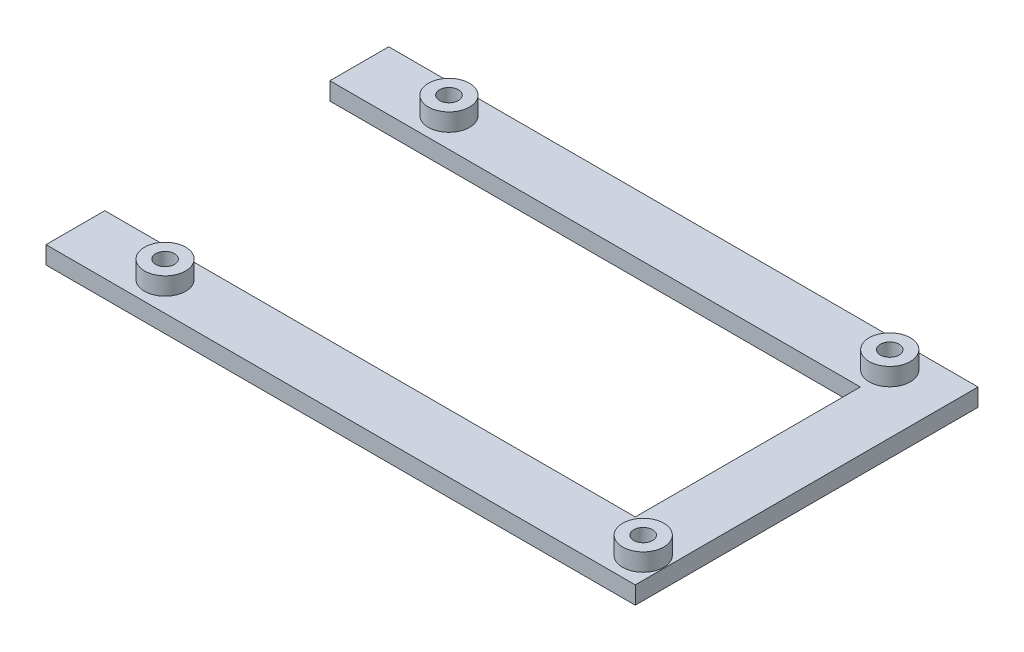
ISO-10303-21;
HEADER;
FILE_DESCRIPTION(('STEP AP214'),'2;1');
FILE_NAME('part.step','',(''),(''),'','','');
FILE_SCHEMA(('AUTOMOTIVE_DESIGN { 1 0 10303 214 1 1 1 1 }'));
ENDSEC;
DATA;
#1=APPLICATION_CONTEXT('core data for automotive mechanical design processes');
#2=APPLICATION_PROTOCOL_DEFINITION('international standard','automotive_design',2000,#1);
#3=PRODUCT_CONTEXT('',#1,'mechanical');
#4=PRODUCT('Part','Part','',(#3));
#5=PRODUCT_RELATED_PRODUCT_CATEGORY('part','',(#4));
#6=PRODUCT_DEFINITION_FORMATION('','',#4);
#7=PRODUCT_DEFINITION_CONTEXT('part definition',#1,'design');
#8=PRODUCT_DEFINITION('design','',#6,#7);
#9=PRODUCT_DEFINITION_SHAPE('','',#8);
#10=(LENGTH_UNIT() NAMED_UNIT(*) SI_UNIT(.MILLI.,.METRE.));
#11=(NAMED_UNIT(*) PLANE_ANGLE_UNIT() SI_UNIT($,.RADIAN.));
#12=(NAMED_UNIT(*) SI_UNIT($,.STERADIAN.) SOLID_ANGLE_UNIT());
#13=UNCERTAINTY_MEASURE_WITH_UNIT(LENGTH_MEASURE(1.E-05),#10,'distance_accuracy_value','');
#14=(GEOMETRIC_REPRESENTATION_CONTEXT(3) GLOBAL_UNCERTAINTY_ASSIGNED_CONTEXT((#13)) GLOBAL_UNIT_ASSIGNED_CONTEXT((#10,
#11,#12)) REPRESENTATION_CONTEXT('',''));
#15=CARTESIAN_POINT('',(0.,0.,0.));
#16=DIRECTION('',(0.,0.,1.));
#17=DIRECTION('',(1.,0.,0.));
#18=AXIS2_PLACEMENT_3D('',#15,#16,#17);
#19=CARTESIAN_POINT('',(0.,3.,0.));
#20=DIRECTION('',(0.,-1.,0.));
#21=DIRECTION('',(0.,0.,-1.));
#22=AXIS2_PLACEMENT_3D('',#19,#20,#21);
#23=PLANE('',#22);
#24=CARTESIAN_POINT('',(96.52,3.,-2.54));
#25=DIRECTION('',(0.,-1.,0.));
#26=DIRECTION('',(0.,0.,-1.));
#27=AXIS2_PLACEMENT_3D('',#24,#25,#26);
#28=CIRCLE('',#27,3.50000000000001);
#29=CARTESIAN_POINT('',(96.52,3.,-6.04000000000001));
#30=VERTEX_POINT('',#29);
#31=EDGE_CURVE('E150',#30,#30,#28,.F.);
#32=ORIENTED_EDGE('',*,*,#31,.F.);
#33=EDGE_LOOP('',(#32));
#34=FACE_BOUND('',#33,.T.);
#35=CARTESIAN_POINT('',(15.24,3.,-50.8));
#36=DIRECTION('',(0.,-1.,0.));
#37=DIRECTION('',(0.,0.,-1.));
#38=AXIS2_PLACEMENT_3D('',#35,#36,#37);
#39=CIRCLE('',#38,3.5);
#40=CARTESIAN_POINT('',(15.24,3.,-54.3));
#41=VERTEX_POINT('',#40);
#42=EDGE_CURVE('E262',#41,#41,#39,.F.);
#43=ORIENTED_EDGE('',*,*,#42,.F.);
#44=EDGE_LOOP('',(#43));
#45=FACE_BOUND('',#44,.T.);
#46=DIRECTION('',(0.,0.,-1.));
#47=VECTOR('',#46,1.);
#48=CARTESIAN_POINT('',(0.,3.,-45.8));
#49=LINE('',#48,#47);
#50=CARTESIAN_POINT('',(0.,3.,-45.8));
#51=VERTEX_POINT('',#50);
#52=CARTESIAN_POINT('',(0.,3.,-55.8));
#53=VERTEX_POINT('',#52);
#54=EDGE_CURVE('E260',#51,#53,#49,.T.);
#55=ORIENTED_EDGE('',*,*,#54,.F.);
#56=DIRECTION('',(1.,0.,0.));
#57=VECTOR('',#56,1.);
#58=CARTESIAN_POINT('',(0.,3.,-45.8));
#59=LINE('',#58,#57);
#60=CARTESIAN_POINT('',(90.17,3.,-45.8));
#61=VERTEX_POINT('',#60);
#62=EDGE_CURVE('E230',#51,#61,#59,.T.);
#63=ORIENTED_EDGE('',*,*,#62,.T.);
#64=DIRECTION('',(0.,0.,-1.));
#65=VECTOR('',#64,1.);
#66=CARTESIAN_POINT('',(90.17,3.,-7.54));
#67=LINE('',#66,#65);
#68=CARTESIAN_POINT('',(90.17,3.,-7.54));
#69=VERTEX_POINT('',#68);
#70=EDGE_CURVE('E216',#69,#61,#67,.T.);
#71=ORIENTED_EDGE('',*,*,#70,.F.);
#72=DIRECTION('',(1.,0.,0.));
#73=VECTOR('',#72,1.);
#74=CARTESIAN_POINT('',(0.,3.,-7.54));
#75=LINE('',#74,#73);
#76=CARTESIAN_POINT('',(0.,3.,-7.54));
#77=VERTEX_POINT('',#76);
#78=EDGE_CURVE('E229',#77,#69,#75,.T.);
#79=ORIENTED_EDGE('',*,*,#78,.F.);
#80=DIRECTION('',(0.,0.,1.));
#81=VECTOR('',#80,1.);
#82=CARTESIAN_POINT('',(0.,3.,-7.54));
#83=LINE('',#82,#81);
#84=CARTESIAN_POINT('',(0.,3.,2.46));
#85=VERTEX_POINT('',#84);
#86=EDGE_CURVE('E234',#77,#85,#83,.T.);
#87=ORIENTED_EDGE('',*,*,#86,.T.);
#88=DIRECTION('',(1.,0.,0.));
#89=VECTOR('',#88,1.);
#90=CARTESIAN_POINT('',(0.,3.,2.46));
#91=LINE('',#90,#89);
#92=CARTESIAN_POINT('',(100.17,3.,2.46));
#93=VERTEX_POINT('',#92);
#94=EDGE_CURVE('E236',#85,#93,#91,.T.);
#95=ORIENTED_EDGE('',*,*,#94,.T.);
#96=DIRECTION('',(0.,0.,-1.));
#97=VECTOR('',#96,1.);
#98=CARTESIAN_POINT('',(100.17,3.,2.46));
#99=LINE('',#98,#97);
#100=CARTESIAN_POINT('',(100.17,3.,-55.8));
#101=VERTEX_POINT('',#100);
#102=EDGE_CURVE('E355',#93,#101,#99,.T.);
#103=ORIENTED_EDGE('',*,*,#102,.T.);
#104=DIRECTION('',(1.,0.,0.));
#105=VECTOR('',#104,1.);
#106=CARTESIAN_POINT('',(0.,3.,-55.8));
#107=LINE('',#106,#105);
#108=EDGE_CURVE('E353',#53,#101,#107,.T.);
#109=ORIENTED_EDGE('',*,*,#108,.F.);
#110=EDGE_LOOP('',(#55,#63,#71,#79,#87,#95,#103,#109));
#111=FACE_BOUND('',#110,.T.);
#112=CARTESIAN_POINT('',(90.17,3.,-50.8));
#113=DIRECTION('',(0.,-1.,0.));
#114=DIRECTION('',(0.,0.,-1.));
#115=AXIS2_PLACEMENT_3D('',#112,#113,#114);
#116=CIRCLE('',#115,3.50000000000001);
#117=CARTESIAN_POINT('',(90.17,3.,-54.3));
#118=VERTEX_POINT('',#117);
#119=EDGE_CURVE('E276',#118,#118,#116,.F.);
#120=ORIENTED_EDGE('',*,*,#119,.F.);
#121=EDGE_LOOP('',(#120));
#122=FACE_BOUND('',#121,.T.);
#123=CARTESIAN_POINT('',(15.24,3.,-2.54));
#124=DIRECTION('',(0.,-1.,0.));
#125=DIRECTION('',(0.,0.,-1.));
#126=AXIS2_PLACEMENT_3D('',#123,#124,#125);
#127=CIRCLE('',#126,3.5);
#128=CARTESIAN_POINT('',(15.24,3.,-6.04));
#129=VERTEX_POINT('',#128);
#130=EDGE_CURVE('E12',#129,#129,#127,.F.);
#131=ORIENTED_EDGE('',*,*,#130,.F.);
#132=EDGE_LOOP('',(#131));
#133=FACE_BOUND('',#132,.T.);
#134=ADVANCED_FACE('F141',(#34,#45,#111,#122,#133),#23,.F.);
#135=CARTESIAN_POINT('',(0.,0.,0.));
#136=DIRECTION('',(0.,-1.,0.));
#137=DIRECTION('',(0.,0.,-1.));
#138=AXIS2_PLACEMENT_3D('',#135,#136,#137);
#139=PLANE('',#138);
#140=CARTESIAN_POINT('',(96.52,0.,-2.54));
#141=DIRECTION('',(0.,1.,0.));
#142=DIRECTION('',(0.,0.,1.));
#143=AXIS2_PLACEMENT_3D('',#140,#141,#142);
#144=CIRCLE('',#143,1.60000000000001);
#145=CARTESIAN_POINT('',(96.52,0.,-0.939999999999995));
#146=VERTEX_POINT('',#145);
#147=EDGE_CURVE('E370',#146,#146,#144,.T.);
#148=ORIENTED_EDGE('',*,*,#147,.T.);
#149=EDGE_LOOP('',(#148));
#150=FACE_BOUND('',#149,.T.);
#151=CARTESIAN_POINT('',(15.24,0.,-2.54));
#152=DIRECTION('',(0.,1.,0.));
#153=DIRECTION('',(0.,0.,1.));
#154=AXIS2_PLACEMENT_3D('',#151,#152,#153);
#155=CIRCLE('',#154,1.6);
#156=CARTESIAN_POINT('',(15.24,0.,-0.94));
#157=VERTEX_POINT('',#156);
#158=EDGE_CURVE('E245',#157,#157,#155,.T.);
#159=ORIENTED_EDGE('',*,*,#158,.T.);
#160=EDGE_LOOP('',(#159));
#161=FACE_BOUND('',#160,.T.);
#162=DIRECTION('',(0.,0.,-1.));
#163=VECTOR('',#162,1.);
#164=CARTESIAN_POINT('',(0.,0.,-45.8));
#165=LINE('',#164,#163);
#166=CARTESIAN_POINT('',(0.,0.,-45.8));
#167=VERTEX_POINT('',#166);
#168=CARTESIAN_POINT('',(0.,0.,-55.8));
#169=VERTEX_POINT('',#168);
#170=EDGE_CURVE('E241',#167,#169,#165,.T.);
#171=ORIENTED_EDGE('',*,*,#170,.T.);
#172=DIRECTION('',(1.,0.,0.));
#173=VECTOR('',#172,1.);
#174=CARTESIAN_POINT('',(0.,0.,-55.8));
#175=LINE('',#174,#173);
#176=CARTESIAN_POINT('',(100.17,0.,-55.8));
#177=VERTEX_POINT('',#176);
#178=EDGE_CURVE('E244',#169,#177,#175,.T.);
#179=ORIENTED_EDGE('',*,*,#178,.T.);
#180=DIRECTION('',(0.,0.,-1.));
#181=VECTOR('',#180,1.);
#182=CARTESIAN_POINT('',(100.17,0.,2.46));
#183=LINE('',#182,#181);
#184=CARTESIAN_POINT('',(100.17,0.,2.46));
#185=VERTEX_POINT('',#184);
#186=EDGE_CURVE('E248',#185,#177,#183,.T.);
#187=ORIENTED_EDGE('',*,*,#186,.F.);
#188=DIRECTION('',(1.,0.,0.));
#189=VECTOR('',#188,1.);
#190=CARTESIAN_POINT('',(0.,0.,2.46));
#191=LINE('',#190,#189);
#192=CARTESIAN_POINT('',(0.,0.,2.46));
#193=VERTEX_POINT('',#192);
#194=EDGE_CURVE('E251',#193,#185,#191,.T.);
#195=ORIENTED_EDGE('',*,*,#194,.F.);
#196=DIRECTION('',(0.,0.,1.));
#197=VECTOR('',#196,1.);
#198=CARTESIAN_POINT('',(0.,0.,-7.54));
#199=LINE('',#198,#197);
#200=CARTESIAN_POINT('',(0.,0.,-7.54));
#201=VERTEX_POINT('',#200);
#202=EDGE_CURVE('E253',#201,#193,#199,.T.);
#203=ORIENTED_EDGE('',*,*,#202,.F.);
#204=DIRECTION('',(1.,0.,0.));
#205=VECTOR('',#204,1.);
#206=CARTESIAN_POINT('',(0.,0.,-7.54));
#207=LINE('',#206,#205);
#208=CARTESIAN_POINT('',(90.17,0.,-7.54));
#209=VERTEX_POINT('',#208);
#210=EDGE_CURVE('E255',#201,#209,#207,.T.);
#211=ORIENTED_EDGE('',*,*,#210,.T.);
#212=DIRECTION('',(0.,0.,-1.));
#213=VECTOR('',#212,1.);
#214=CARTESIAN_POINT('',(90.17,0.,-7.54));
#215=LINE('',#214,#213);
#216=CARTESIAN_POINT('',(90.17,0.,-45.8));
#217=VERTEX_POINT('',#216);
#218=EDGE_CURVE('E218',#209,#217,#215,.T.);
#219=ORIENTED_EDGE('',*,*,#218,.T.);
#220=DIRECTION('',(1.,0.,0.));
#221=VECTOR('',#220,1.);
#222=CARTESIAN_POINT('',(0.,0.,-45.8));
#223=LINE('',#222,#221);
#224=EDGE_CURVE('E258',#167,#217,#223,.T.);
#225=ORIENTED_EDGE('',*,*,#224,.F.);
#226=EDGE_LOOP('',(#171,#179,#187,#195,#203,#211,#219,#225));
#227=FACE_BOUND('',#226,.T.);
#228=CARTESIAN_POINT('',(15.24,0.,-50.8));
#229=DIRECTION('',(0.,1.,0.));
#230=DIRECTION('',(0.,0.,1.));
#231=AXIS2_PLACEMENT_3D('',#228,#229,#230);
#232=CIRCLE('',#231,1.6);
#233=CARTESIAN_POINT('',(15.24,0.,-49.2));
#234=VERTEX_POINT('',#233);
#235=EDGE_CURVE('E367',#234,#234,#232,.T.);
#236=ORIENTED_EDGE('',*,*,#235,.T.);
#237=EDGE_LOOP('',(#236));
#238=FACE_BOUND('',#237,.T.);
#239=CARTESIAN_POINT('',(90.17,0.,-50.8));
#240=DIRECTION('',(0.,1.,0.));
#241=DIRECTION('',(0.,0.,1.));
#242=AXIS2_PLACEMENT_3D('',#239,#240,#241);
#243=CIRCLE('',#242,1.60000000000001);
#244=CARTESIAN_POINT('',(90.17,0.,-49.2));
#245=VERTEX_POINT('',#244);
#246=EDGE_CURVE('E373',#245,#245,#243,.T.);
#247=ORIENTED_EDGE('',*,*,#246,.T.);
#248=EDGE_LOOP('',(#247));
#249=FACE_BOUND('',#248,.T.);
#250=ADVANCED_FACE('F285',(#150,#161,#227,#238,#249),#139,.T.);
#251=CARTESIAN_POINT('',(0.,3.,-45.8));
#252=DIRECTION('',(-1.,0.,0.));
#253=DIRECTION('',(0.,0.,1.));
#254=AXIS2_PLACEMENT_3D('',#251,#252,#253);
#255=PLANE('',#254);
#256=ORIENTED_EDGE('',*,*,#170,.F.);
#257=DIRECTION('',(0.,-1.,0.));
#258=VECTOR('',#257,1.);
#259=CARTESIAN_POINT('',(0.,3.,-45.8));
#260=LINE('',#259,#258);
#261=EDGE_CURVE('E158',#51,#167,#260,.T.);
#262=ORIENTED_EDGE('',*,*,#261,.F.);
#263=ORIENTED_EDGE('',*,*,#54,.T.);
#264=DIRECTION('',(0.,-1.,0.));
#265=VECTOR('',#264,1.);
#266=CARTESIAN_POINT('',(0.,3.,-55.8));
#267=LINE('',#266,#265);
#268=EDGE_CURVE('E199',#53,#169,#267,.T.);
#269=ORIENTED_EDGE('',*,*,#268,.T.);
#270=EDGE_LOOP('',(#256,#262,#263,#269));
#271=FACE_BOUND('',#270,.T.);
#272=ADVANCED_FACE('F143',(#271),#255,.T.);
#273=CARTESIAN_POINT('',(0.,3.,-45.8));
#274=DIRECTION('',(0.,0.,-1.));
#275=DIRECTION('',(-1.,0.,0.));
#276=AXIS2_PLACEMENT_3D('',#273,#274,#275);
#277=PLANE('',#276);
#278=ORIENTED_EDGE('',*,*,#224,.T.);
#279=DIRECTION('',(0.,-1.,0.));
#280=VECTOR('',#279,1.);
#281=CARTESIAN_POINT('',(90.17,3.,-45.8));
#282=LINE('',#281,#280);
#283=EDGE_CURVE('E188',#61,#217,#282,.T.);
#284=ORIENTED_EDGE('',*,*,#283,.F.);
#285=ORIENTED_EDGE('',*,*,#62,.F.);
#286=ORIENTED_EDGE('',*,*,#261,.T.);
#287=EDGE_LOOP('',(#278,#284,#285,#286));
#288=FACE_BOUND('',#287,.T.);
#289=ADVANCED_FACE('F327',(#288),#277,.F.);
#290=CARTESIAN_POINT('',(90.17,3.,-7.54));
#291=DIRECTION('',(-1.,0.,0.));
#292=DIRECTION('',(0.,0.,1.));
#293=AXIS2_PLACEMENT_3D('',#290,#291,#292);
#294=PLANE('',#293);
#295=ORIENTED_EDGE('',*,*,#218,.F.);
#296=DIRECTION('',(0.,-1.,0.));
#297=VECTOR('',#296,1.);
#298=CARTESIAN_POINT('',(90.17,3.,-7.54));
#299=LINE('',#298,#297);
#300=EDGE_CURVE('E213',#69,#209,#299,.T.);
#301=ORIENTED_EDGE('',*,*,#300,.F.);
#302=ORIENTED_EDGE('',*,*,#70,.T.);
#303=ORIENTED_EDGE('',*,*,#283,.T.);
#304=EDGE_LOOP('',(#295,#301,#302,#303));
#305=FACE_BOUND('',#304,.T.);
#306=ADVANCED_FACE('F215',(#305),#294,.T.);
#307=CARTESIAN_POINT('',(0.,3.,-7.54));
#308=DIRECTION('',(0.,0.,-1.));
#309=DIRECTION('',(-1.,0.,0.));
#310=AXIS2_PLACEMENT_3D('',#307,#308,#309);
#311=PLANE('',#310);
#312=ORIENTED_EDGE('',*,*,#210,.F.);
#313=DIRECTION('',(0.,-1.,0.));
#314=VECTOR('',#313,1.);
#315=CARTESIAN_POINT('',(0.,3.,-7.54));
#316=LINE('',#315,#314);
#317=EDGE_CURVE('E223',#77,#201,#316,.T.);
#318=ORIENTED_EDGE('',*,*,#317,.F.);
#319=ORIENTED_EDGE('',*,*,#78,.T.);
#320=ORIENTED_EDGE('',*,*,#300,.T.);
#321=EDGE_LOOP('',(#312,#318,#319,#320));
#322=FACE_BOUND('',#321,.T.);
#323=ADVANCED_FACE('F232',(#322),#311,.T.);
#324=CARTESIAN_POINT('',(0.,3.,-7.54));
#325=DIRECTION('',(1.,0.,0.));
#326=DIRECTION('',(0.,0.,-1.));
#327=AXIS2_PLACEMENT_3D('',#324,#325,#326);
#328=PLANE('',#327);
#329=ORIENTED_EDGE('',*,*,#202,.T.);
#330=DIRECTION('',(0.,-1.,0.));
#331=VECTOR('',#330,1.);
#332=CARTESIAN_POINT('',(0.,3.,2.46));
#333=LINE('',#332,#331);
#334=EDGE_CURVE('E265',#85,#193,#333,.T.);
#335=ORIENTED_EDGE('',*,*,#334,.F.);
#336=ORIENTED_EDGE('',*,*,#86,.F.);
#337=ORIENTED_EDGE('',*,*,#317,.T.);
#338=EDGE_LOOP('',(#329,#335,#336,#337));
#339=FACE_BOUND('',#338,.T.);
#340=ADVANCED_FACE('F334',(#339),#328,.F.);
#341=CARTESIAN_POINT('',(0.,3.,2.46));
#342=DIRECTION('',(0.,0.,-1.));
#343=DIRECTION('',(-1.,0.,0.));
#344=AXIS2_PLACEMENT_3D('',#341,#342,#343);
#345=PLANE('',#344);
#346=ORIENTED_EDGE('',*,*,#194,.T.);
#347=DIRECTION('',(0.,-1.,0.));
#348=VECTOR('',#347,1.);
#349=CARTESIAN_POINT('',(100.17,3.,2.46));
#350=LINE('',#349,#348);
#351=EDGE_CURVE('E268',#93,#185,#350,.T.);
#352=ORIENTED_EDGE('',*,*,#351,.F.);
#353=ORIENTED_EDGE('',*,*,#94,.F.);
#354=ORIENTED_EDGE('',*,*,#334,.T.);
#355=EDGE_LOOP('',(#346,#352,#353,#354));
#356=FACE_BOUND('',#355,.T.);
#357=ADVANCED_FACE('F337',(#356),#345,.F.);
#358=CARTESIAN_POINT('',(100.17,3.,2.46));
#359=DIRECTION('',(-1.,0.,0.));
#360=DIRECTION('',(0.,0.,1.));
#361=AXIS2_PLACEMENT_3D('',#358,#359,#360);
#362=PLANE('',#361);
#363=ORIENTED_EDGE('',*,*,#186,.T.);
#364=DIRECTION('',(0.,-1.,0.));
#365=VECTOR('',#364,1.);
#366=CARTESIAN_POINT('',(100.17,3.,-55.8));
#367=LINE('',#366,#365);
#368=EDGE_CURVE('E271',#101,#177,#367,.T.);
#369=ORIENTED_EDGE('',*,*,#368,.F.);
#370=ORIENTED_EDGE('',*,*,#102,.F.);
#371=ORIENTED_EDGE('',*,*,#351,.T.);
#372=EDGE_LOOP('',(#363,#369,#370,#371));
#373=FACE_BOUND('',#372,.T.);
#374=ADVANCED_FACE('F341',(#373),#362,.F.);
#375=CARTESIAN_POINT('',(0.,3.,-55.8));
#376=DIRECTION('',(0.,0.,-1.));
#377=DIRECTION('',(-1.,0.,0.));
#378=AXIS2_PLACEMENT_3D('',#375,#376,#377);
#379=PLANE('',#378);
#380=ORIENTED_EDGE('',*,*,#178,.F.);
#381=ORIENTED_EDGE('',*,*,#268,.F.);
#382=ORIENTED_EDGE('',*,*,#108,.T.);
#383=ORIENTED_EDGE('',*,*,#368,.T.);
#384=EDGE_LOOP('',(#380,#381,#382,#383));
#385=FACE_BOUND('',#384,.T.);
#386=ADVANCED_FACE('F321',(#385),#379,.T.);
#387=CARTESIAN_POINT('',(15.24,3.,-2.54));
#388=DIRECTION('',(0.,-1.,0.));
#389=DIRECTION('',(0.,0.,-1.));
#390=AXIS2_PLACEMENT_3D('',#387,#388,#389);
#391=CYLINDRICAL_SURFACE('',#390,1.6);
#392=ORIENTED_EDGE('',*,*,#158,.F.);
#393=EDGE_LOOP('',(#392));
#394=FACE_BOUND('',#393,.T.);
#395=CARTESIAN_POINT('',(15.24,6.,-2.54));
#396=DIRECTION('',(0.,1.,0.));
#397=DIRECTION('',(0.,0.,1.));
#398=AXIS2_PLACEMENT_3D('',#395,#396,#397);
#399=CIRCLE('',#398,1.6);
#400=CARTESIAN_POINT('',(15.24,6.,-0.94));
#401=VERTEX_POINT('',#400);
#402=EDGE_CURVE('E397',#401,#401,#399,.T.);
#403=ORIENTED_EDGE('',*,*,#402,.T.);
#404=EDGE_LOOP('',(#403));
#405=FACE_BOUND('',#404,.T.);
#406=ADVANCED_FACE('F318',(#394,#405),#391,.F.);
#407=CARTESIAN_POINT('',(15.24,3.,-50.8));
#408=DIRECTION('',(0.,-1.,0.));
#409=DIRECTION('',(0.,0.,-1.));
#410=AXIS2_PLACEMENT_3D('',#407,#408,#409);
#411=CYLINDRICAL_SURFACE('',#410,1.6);
#412=ORIENTED_EDGE('',*,*,#235,.F.);
#413=EDGE_LOOP('',(#412));
#414=FACE_BOUND('',#413,.T.);
#415=CARTESIAN_POINT('',(15.24,6.,-50.8));
#416=DIRECTION('',(0.,1.,0.));
#417=DIRECTION('',(0.,0.,1.));
#418=AXIS2_PLACEMENT_3D('',#415,#416,#417);
#419=CIRCLE('',#418,1.6);
#420=CARTESIAN_POINT('',(15.24,6.,-49.2));
#421=VERTEX_POINT('',#420);
#422=EDGE_CURVE('E379',#421,#421,#419,.T.);
#423=ORIENTED_EDGE('',*,*,#422,.T.);
#424=EDGE_LOOP('',(#423));
#425=FACE_BOUND('',#424,.T.);
#426=ADVANCED_FACE('F314',(#414,#425),#411,.F.);
#427=CARTESIAN_POINT('',(96.52,3.,-2.54));
#428=DIRECTION('',(0.,-1.,0.));
#429=DIRECTION('',(0.,0.,-1.));
#430=AXIS2_PLACEMENT_3D('',#427,#428,#429);
#431=CYLINDRICAL_SURFACE('',#430,1.60000000000001);
#432=ORIENTED_EDGE('',*,*,#147,.F.);
#433=EDGE_LOOP('',(#432));
#434=FACE_BOUND('',#433,.T.);
#435=CARTESIAN_POINT('',(96.52,6.,-2.54));
#436=DIRECTION('',(0.,1.,0.));
#437=DIRECTION('',(0.,0.,1.));
#438=AXIS2_PLACEMENT_3D('',#435,#436,#437);
#439=CIRCLE('',#438,1.60000000000001);
#440=CARTESIAN_POINT('',(96.52,6.,-0.939999999999995));
#441=VERTEX_POINT('',#440);
#442=EDGE_CURVE('E391',#441,#441,#439,.T.);
#443=ORIENTED_EDGE('',*,*,#442,.T.);
#444=EDGE_LOOP('',(#443));
#445=FACE_BOUND('',#444,.T.);
#446=ADVANCED_FACE('F310',(#434,#445),#431,.F.);
#447=CARTESIAN_POINT('',(90.17,3.,-50.8));
#448=DIRECTION('',(0.,-1.,0.));
#449=DIRECTION('',(0.,0.,-1.));
#450=AXIS2_PLACEMENT_3D('',#447,#448,#449);
#451=CYLINDRICAL_SURFACE('',#450,1.60000000000001);
#452=ORIENTED_EDGE('',*,*,#246,.F.);
#453=EDGE_LOOP('',(#452));
#454=FACE_BOUND('',#453,.T.);
#455=CARTESIAN_POINT('',(90.17,6.,-50.8));
#456=DIRECTION('',(0.,1.,0.));
#457=DIRECTION('',(0.,0.,1.));
#458=AXIS2_PLACEMENT_3D('',#455,#456,#457);
#459=CIRCLE('',#458,1.6);
#460=CARTESIAN_POINT('',(90.17,6.,-49.2));
#461=VERTEX_POINT('',#460);
#462=EDGE_CURVE('E385',#461,#461,#459,.T.);
#463=ORIENTED_EDGE('',*,*,#462,.T.);
#464=EDGE_LOOP('',(#463));
#465=FACE_BOUND('',#464,.T.);
#466=ADVANCED_FACE('F302',(#454,#465),#451,.F.);
#467=CARTESIAN_POINT('',(15.24,6.,-50.8));
#468=DIRECTION('',(0.,1.,0.));
#469=DIRECTION('',(0.,0.,1.));
#470=AXIS2_PLACEMENT_3D('',#467,#468,#469);
#471=PLANE('',#470);
#472=CARTESIAN_POINT('',(15.24,6.,-50.8));
#473=DIRECTION('',(0.,1.,0.));
#474=DIRECTION('',(0.,0.,1.));
#475=AXIS2_PLACEMENT_3D('',#472,#473,#474);
#476=CIRCLE('',#475,3.5);
#477=CARTESIAN_POINT('',(15.24,6.,-47.3));
#478=VERTEX_POINT('',#477);
#479=EDGE_CURVE('E376',#478,#478,#476,.T.);
#480=ORIENTED_EDGE('',*,*,#479,.T.);
#481=EDGE_LOOP('',(#480));
#482=FACE_BOUND('',#481,.T.);
#483=ORIENTED_EDGE('',*,*,#422,.F.);
#484=EDGE_LOOP('',(#483));
#485=FACE_BOUND('',#484,.T.);
#486=ADVANCED_FACE('F292',(#482,#485),#471,.T.);
#487=CARTESIAN_POINT('',(15.24,6.,-50.8));
#488=DIRECTION('',(0.,-1.,0.));
#489=DIRECTION('',(0.,0.,-1.));
#490=AXIS2_PLACEMENT_3D('',#487,#488,#489);
#491=CYLINDRICAL_SURFACE('',#490,3.5);
#492=ORIENTED_EDGE('',*,*,#479,.F.);
#493=EDGE_LOOP('',(#492));
#494=FACE_BOUND('',#493,.T.);
#495=ORIENTED_EDGE('',*,*,#42,.T.);
#496=EDGE_LOOP('',(#495));
#497=FACE_BOUND('',#496,.T.);
#498=ADVANCED_FACE('F289',(#494,#497),#491,.T.);
#499=CARTESIAN_POINT('',(90.17,6.,-50.8));
#500=DIRECTION('',(0.,1.,0.));
#501=DIRECTION('',(0.,0.,1.));
#502=AXIS2_PLACEMENT_3D('',#499,#500,#501);
#503=PLANE('',#502);
#504=CARTESIAN_POINT('',(90.17,6.,-50.8));
#505=DIRECTION('',(0.,1.,0.));
#506=DIRECTION('',(0.,0.,1.));
#507=AXIS2_PLACEMENT_3D('',#504,#505,#506);
#508=CIRCLE('',#507,3.50000000000001);
#509=CARTESIAN_POINT('',(90.17,6.,-47.3));
#510=VERTEX_POINT('',#509);
#511=EDGE_CURVE('E382',#510,#510,#508,.T.);
#512=ORIENTED_EDGE('',*,*,#511,.T.);
#513=EDGE_LOOP('',(#512));
#514=FACE_BOUND('',#513,.T.);
#515=ORIENTED_EDGE('',*,*,#462,.F.);
#516=EDGE_LOOP('',(#515));
#517=FACE_BOUND('',#516,.T.);
#518=ADVANCED_FACE('F291',(#514,#517),#503,.T.);
#519=CARTESIAN_POINT('',(90.17,6.,-50.8));
#520=DIRECTION('',(0.,-1.,0.));
#521=DIRECTION('',(0.,0.,-1.));
#522=AXIS2_PLACEMENT_3D('',#519,#520,#521);
#523=CYLINDRICAL_SURFACE('',#522,3.50000000000001);
#524=ORIENTED_EDGE('',*,*,#511,.F.);
#525=EDGE_LOOP('',(#524));
#526=FACE_BOUND('',#525,.T.);
#527=ORIENTED_EDGE('',*,*,#119,.T.);
#528=EDGE_LOOP('',(#527));
#529=FACE_BOUND('',#528,.T.);
#530=ADVANCED_FACE('F299',(#526,#529),#523,.T.);
#531=CARTESIAN_POINT('',(96.52,6.,-2.54));
#532=DIRECTION('',(0.,1.,0.));
#533=DIRECTION('',(0.,0.,1.));
#534=AXIS2_PLACEMENT_3D('',#531,#532,#533);
#535=PLANE('',#534);
#536=CARTESIAN_POINT('',(96.52,6.,-2.54));
#537=DIRECTION('',(0.,1.,0.));
#538=DIRECTION('',(0.,0.,1.));
#539=AXIS2_PLACEMENT_3D('',#536,#537,#538);
#540=CIRCLE('',#539,3.50000000000001);
#541=CARTESIAN_POINT('',(96.52,6.,0.960000000000007));
#542=VERTEX_POINT('',#541);
#543=EDGE_CURVE('E388',#542,#542,#540,.T.);
#544=ORIENTED_EDGE('',*,*,#543,.T.);
#545=EDGE_LOOP('',(#544));
#546=FACE_BOUND('',#545,.T.);
#547=ORIENTED_EDGE('',*,*,#442,.F.);
#548=EDGE_LOOP('',(#547));
#549=FACE_BOUND('',#548,.T.);
#550=ADVANCED_FACE('F413',(#546,#549),#535,.T.);
#551=CARTESIAN_POINT('',(96.52,6.,-2.54));
#552=DIRECTION('',(0.,-1.,0.));
#553=DIRECTION('',(0.,0.,-1.));
#554=AXIS2_PLACEMENT_3D('',#551,#552,#553);
#555=CYLINDRICAL_SURFACE('',#554,3.50000000000001);
#556=ORIENTED_EDGE('',*,*,#543,.F.);
#557=EDGE_LOOP('',(#556));
#558=FACE_BOUND('',#557,.T.);
#559=ORIENTED_EDGE('',*,*,#31,.T.);
#560=EDGE_LOOP('',(#559));
#561=FACE_BOUND('',#560,.T.);
#562=ADVANCED_FACE('F281',(#558,#561),#555,.T.);
#563=CARTESIAN_POINT('',(15.24,6.,-2.54));
#564=DIRECTION('',(0.,1.,0.));
#565=DIRECTION('',(0.,0.,1.));
#566=AXIS2_PLACEMENT_3D('',#563,#564,#565);
#567=PLANE('',#566);
#568=CARTESIAN_POINT('',(15.24,6.,-2.54));
#569=DIRECTION('',(0.,1.,0.));
#570=DIRECTION('',(0.,0.,1.));
#571=AXIS2_PLACEMENT_3D('',#568,#569,#570);
#572=CIRCLE('',#571,3.5);
#573=CARTESIAN_POINT('',(15.24,6.,0.960000000000002));
#574=VERTEX_POINT('',#573);
#575=EDGE_CURVE('E394',#574,#574,#572,.T.);
#576=ORIENTED_EDGE('',*,*,#575,.T.);
#577=EDGE_LOOP('',(#576));
#578=FACE_BOUND('',#577,.T.);
#579=ORIENTED_EDGE('',*,*,#402,.F.);
#580=EDGE_LOOP('',(#579));
#581=FACE_BOUND('',#580,.T.);
#582=ADVANCED_FACE('F402',(#578,#581),#567,.T.);
#583=CARTESIAN_POINT('',(15.24,6.,-2.54));
#584=DIRECTION('',(0.,-1.,0.));
#585=DIRECTION('',(0.,0.,-1.));
#586=AXIS2_PLACEMENT_3D('',#583,#584,#585);
#587=CYLINDRICAL_SURFACE('',#586,3.5);
#588=ORIENTED_EDGE('',*,*,#575,.F.);
#589=EDGE_LOOP('',(#588));
#590=FACE_BOUND('',#589,.T.);
#591=ORIENTED_EDGE('',*,*,#130,.T.);
#592=EDGE_LOOP('',(#591));
#593=FACE_BOUND('',#592,.T.);
#594=ADVANCED_FACE('F404',(#590,#593),#587,.T.);
#595=CLOSED_SHELL('',(#134,#250,#272,#289,#306,#323,#340,#357,#374,#386,#406,#426,#446,#466,
#486,#498,#518,#530,#550,#562,#582,#594));
#596=MANIFOLD_SOLID_BREP('B2',#595);
#597=ADVANCED_BREP_SHAPE_REPRESENTATION('',(#18,#596),#14);
#598=SHAPE_DEFINITION_REPRESENTATION(#9,#597);
ENDSEC;
END-ISO-10303-21;
